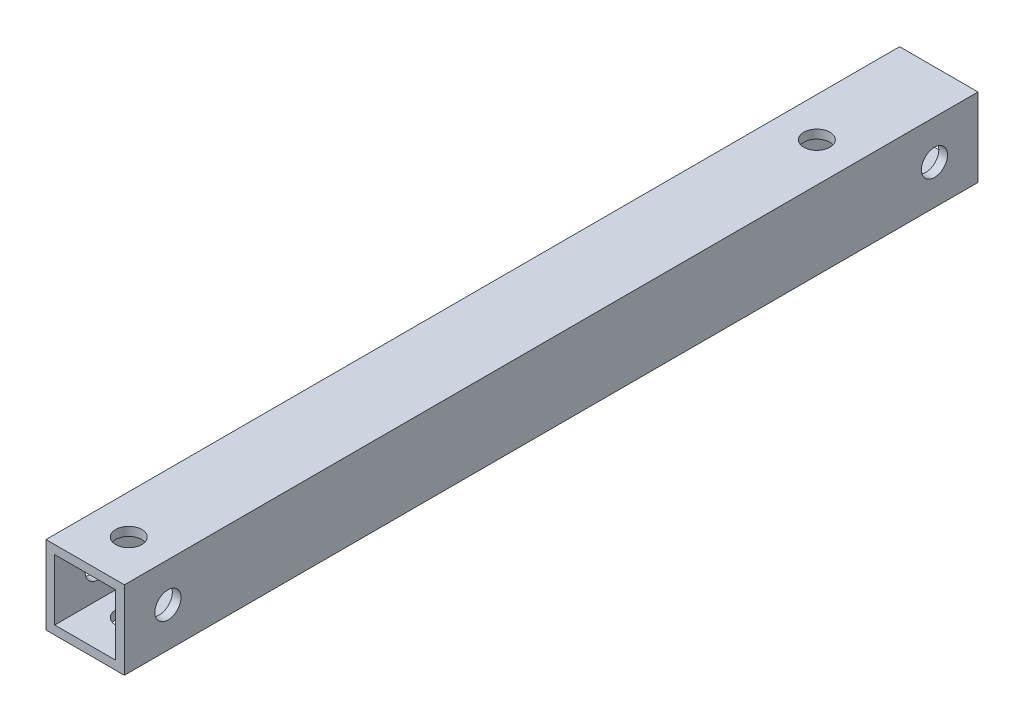
ISO-10303-21;
HEADER;
FILE_DESCRIPTION(('STEP AP214'),'2;1');
FILE_NAME('part.step','',(''),(''),'','','');
FILE_SCHEMA(('AUTOMOTIVE_DESIGN { 1 0 10303 214 1 1 1 1 }'));
ENDSEC;
DATA;
#1=APPLICATION_CONTEXT('core data for automotive mechanical design processes');
#2=APPLICATION_PROTOCOL_DEFINITION('international standard','automotive_design',2000,#1);
#3=PRODUCT_CONTEXT('',#1,'mechanical');
#4=PRODUCT('Part','Part','',(#3));
#5=PRODUCT_RELATED_PRODUCT_CATEGORY('part','',(#4));
#6=PRODUCT_DEFINITION_FORMATION('','',#4);
#7=PRODUCT_DEFINITION_CONTEXT('part definition',#1,'design');
#8=PRODUCT_DEFINITION('design','',#6,#7);
#9=PRODUCT_DEFINITION_SHAPE('','',#8);
#10=(LENGTH_UNIT() NAMED_UNIT(*) SI_UNIT(.MILLI.,.METRE.));
#11=(NAMED_UNIT(*) PLANE_ANGLE_UNIT() SI_UNIT($,.RADIAN.));
#12=(NAMED_UNIT(*) SI_UNIT($,.STERADIAN.) SOLID_ANGLE_UNIT());
#13=UNCERTAINTY_MEASURE_WITH_UNIT(LENGTH_MEASURE(1.E-05),#10,'distance_accuracy_value','');
#14=(GEOMETRIC_REPRESENTATION_CONTEXT(3) GLOBAL_UNCERTAINTY_ASSIGNED_CONTEXT((#13)) GLOBAL_UNIT_ASSIGNED_CONTEXT((#10,
#11,#12)) REPRESENTATION_CONTEXT('',''));
#15=CARTESIAN_POINT('',(0.,0.,0.));
#16=DIRECTION('',(0.,0.,1.));
#17=DIRECTION('',(1.,0.,0.));
#18=AXIS2_PLACEMENT_3D('',#15,#16,#17);
#19=CARTESIAN_POINT('',(4.5,4.5,98.));
#20=DIRECTION('',(-1.,0.,0.));
#21=DIRECTION('',(0.,0.,1.));
#22=AXIS2_PLACEMENT_3D('',#19,#20,#21);
#23=PLANE('',#22);
#24=CARTESIAN_POINT('',(4.5,0.,5.));
#25=DIRECTION('',(-1.,0.,0.));
#26=DIRECTION('',(0.,0.,1.));
#27=AXIS2_PLACEMENT_3D('',#24,#25,#26);
#28=CIRCLE('',#27,1.5);
#29=CARTESIAN_POINT('',(4.5,0.,6.5));
#30=VERTEX_POINT('',#29);
#31=EDGE_CURVE('E194',#30,#30,#28,.T.);
#32=ORIENTED_EDGE('',*,*,#31,.T.);
#33=EDGE_LOOP('',(#32));
#34=FACE_BOUND('',#33,.T.);
#35=CARTESIAN_POINT('',(4.5,0.,93.));
#36=DIRECTION('',(-1.,0.,0.));
#37=DIRECTION('',(0.,0.,1.));
#38=AXIS2_PLACEMENT_3D('',#35,#36,#37);
#39=CIRCLE('',#38,1.5);
#40=CARTESIAN_POINT('',(4.5,0.,94.5));
#41=VERTEX_POINT('',#40);
#42=EDGE_CURVE('E179',#41,#41,#39,.T.);
#43=ORIENTED_EDGE('',*,*,#42,.T.);
#44=EDGE_LOOP('',(#43));
#45=FACE_BOUND('',#44,.T.);
#46=DIRECTION('',(0.,1.,0.));
#47=VECTOR('',#46,1.);
#48=CARTESIAN_POINT('',(4.5,4.5,0.));
#49=LINE('',#48,#47);
#50=CARTESIAN_POINT('',(4.5,-4.5,0.));
#51=VERTEX_POINT('',#50);
#52=CARTESIAN_POINT('',(4.5,4.5,0.));
#53=VERTEX_POINT('',#52);
#54=EDGE_CURVE('E126',#51,#53,#49,.T.);
#55=ORIENTED_EDGE('',*,*,#54,.T.);
#56=DIRECTION('',(0.,0.,-1.));
#57=VECTOR('',#56,1.);
#58=CARTESIAN_POINT('',(4.5,4.5,98.));
#59=LINE('',#58,#57);
#60=CARTESIAN_POINT('',(4.5,4.5,98.));
#61=VERTEX_POINT('',#60);
#62=EDGE_CURVE('E155',#61,#53,#59,.T.);
#63=ORIENTED_EDGE('',*,*,#62,.F.);
#64=DIRECTION('',(0.,1.,0.));
#65=VECTOR('',#64,1.);
#66=CARTESIAN_POINT('',(4.5,4.5,98.));
#67=LINE('',#66,#65);
#68=CARTESIAN_POINT('',(4.5,-4.5,98.));
#69=VERTEX_POINT('',#68);
#70=EDGE_CURVE('E129',#69,#61,#67,.T.);
#71=ORIENTED_EDGE('',*,*,#70,.F.);
#72=DIRECTION('',(0.,0.,-1.));
#73=VECTOR('',#72,1.);
#74=CARTESIAN_POINT('',(4.5,-4.5,98.));
#75=LINE('',#74,#73);
#76=EDGE_CURVE('E139',#69,#51,#75,.T.);
#77=ORIENTED_EDGE('',*,*,#76,.T.);
#78=EDGE_LOOP('',(#55,#63,#71,#77));
#79=FACE_BOUND('',#78,.T.);
#80=ADVANCED_FACE('F34',(#34,#45,#79),#23,.F.);
#81=CARTESIAN_POINT('',(-4.5,4.5,98.));
#82=DIRECTION('',(0.,-1.,0.));
#83=DIRECTION('',(0.,0.,-1.));
#84=AXIS2_PLACEMENT_3D('',#81,#82,#83);
#85=PLANE('',#84);
#86=CARTESIAN_POINT('',(0.,4.5,14.));
#87=DIRECTION('',(0.,1.,0.));
#88=DIRECTION('',(0.,0.,1.));
#89=AXIS2_PLACEMENT_3D('',#86,#87,#88);
#90=CIRCLE('',#89,1.5);
#91=CARTESIAN_POINT('',(0.,4.5,15.5));
#92=VERTEX_POINT('',#91);
#93=EDGE_CURVE('E167',#92,#92,#90,.T.);
#94=ORIENTED_EDGE('',*,*,#93,.F.);
#95=EDGE_LOOP('',(#94));
#96=FACE_BOUND('',#95,.T.);
#97=CARTESIAN_POINT('',(0.,4.5,93.));
#98=DIRECTION('',(0.,1.,0.));
#99=DIRECTION('',(0.,0.,1.));
#100=AXIS2_PLACEMENT_3D('',#97,#98,#99);
#101=CIRCLE('',#100,1.5);
#102=CARTESIAN_POINT('',(0.,4.5,94.5));
#103=VERTEX_POINT('',#102);
#104=EDGE_CURVE('E197',#103,#103,#101,.T.);
#105=ORIENTED_EDGE('',*,*,#104,.F.);
#106=EDGE_LOOP('',(#105));
#107=FACE_BOUND('',#106,.T.);
#108=DIRECTION('',(-1.,0.,0.));
#109=VECTOR('',#108,1.);
#110=CARTESIAN_POINT('',(-4.5,4.5,0.));
#111=LINE('',#110,#109);
#112=CARTESIAN_POINT('',(-4.5,4.5,0.));
#113=VERTEX_POINT('',#112);
#114=EDGE_CURVE('E142',#53,#113,#111,.T.);
#115=ORIENTED_EDGE('',*,*,#114,.T.);
#116=DIRECTION('',(0.,0.,-1.));
#117=VECTOR('',#116,1.);
#118=CARTESIAN_POINT('',(-4.5,4.5,98.));
#119=LINE('',#118,#117);
#120=CARTESIAN_POINT('',(-4.5,4.5,98.));
#121=VERTEX_POINT('',#120);
#122=EDGE_CURVE('E152',#121,#113,#119,.T.);
#123=ORIENTED_EDGE('',*,*,#122,.F.);
#124=DIRECTION('',(-1.,0.,0.));
#125=VECTOR('',#124,1.);
#126=CARTESIAN_POINT('',(-4.5,4.5,98.));
#127=LINE('',#126,#125);
#128=EDGE_CURVE('E132',#61,#121,#127,.T.);
#129=ORIENTED_EDGE('',*,*,#128,.F.);
#130=ORIENTED_EDGE('',*,*,#62,.T.);
#131=EDGE_LOOP('',(#115,#123,#129,#130));
#132=FACE_BOUND('',#131,.T.);
#133=ADVANCED_FACE('F237',(#96,#107,#132),#85,.F.);
#134=CARTESIAN_POINT('',(-4.5,4.5,98.));
#135=DIRECTION('',(1.,0.,0.));
#136=DIRECTION('',(0.,1.,0.));
#137=AXIS2_PLACEMENT_3D('',#134,#135,#136);
#138=PLANE('',#137);
#139=CARTESIAN_POINT('',(-4.5,0.,5.));
#140=DIRECTION('',(-1.,0.,0.));
#141=DIRECTION('',(0.,-1.,0.));
#142=AXIS2_PLACEMENT_3D('',#139,#140,#141);
#143=CIRCLE('',#142,1.5);
#144=CARTESIAN_POINT('',(-4.5,-1.50000000000001,5.));
#145=VERTEX_POINT('',#144);
#146=EDGE_CURVE('E175',#145,#145,#143,.T.);
#147=ORIENTED_EDGE('',*,*,#146,.F.);
#148=EDGE_LOOP('',(#147));
#149=FACE_BOUND('',#148,.T.);
#150=CARTESIAN_POINT('',(-4.5,0.,93.));
#151=DIRECTION('',(-1.,0.,0.));
#152=DIRECTION('',(0.,-1.,0.));
#153=AXIS2_PLACEMENT_3D('',#150,#151,#152);
#154=CIRCLE('',#153,1.5);
#155=CARTESIAN_POINT('',(-4.5,-1.5,93.));
#156=VERTEX_POINT('',#155);
#157=EDGE_CURVE('E182',#156,#156,#154,.T.);
#158=ORIENTED_EDGE('',*,*,#157,.F.);
#159=EDGE_LOOP('',(#158));
#160=FACE_BOUND('',#159,.T.);
#161=DIRECTION('',(0.,-1.,0.));
#162=VECTOR('',#161,1.);
#163=CARTESIAN_POINT('',(-4.5,4.5,0.));
#164=LINE('',#163,#162);
#165=CARTESIAN_POINT('',(-4.5,-4.5,0.));
#166=VERTEX_POINT('',#165);
#167=EDGE_CURVE('E144',#113,#166,#164,.T.);
#168=ORIENTED_EDGE('',*,*,#167,.T.);
#169=DIRECTION('',(0.,0.,-1.));
#170=VECTOR('',#169,1.);
#171=CARTESIAN_POINT('',(-4.5,-4.5,98.));
#172=LINE('',#171,#170);
#173=CARTESIAN_POINT('',(-4.5,-4.5,98.));
#174=VERTEX_POINT('',#173);
#175=EDGE_CURVE('E149',#174,#166,#172,.T.);
#176=ORIENTED_EDGE('',*,*,#175,.F.);
#177=DIRECTION('',(0.,-1.,0.));
#178=VECTOR('',#177,1.);
#179=CARTESIAN_POINT('',(-4.5,4.5,98.));
#180=LINE('',#179,#178);
#181=EDGE_CURVE('E135',#121,#174,#180,.T.);
#182=ORIENTED_EDGE('',*,*,#181,.F.);
#183=ORIENTED_EDGE('',*,*,#122,.T.);
#184=EDGE_LOOP('',(#168,#176,#182,#183));
#185=FACE_BOUND('',#184,.T.);
#186=ADVANCED_FACE('F242',(#149,#160,#185),#138,.F.);
#187=CARTESIAN_POINT('',(-4.5,-4.5,98.));
#188=DIRECTION('',(0.,1.,0.));
#189=DIRECTION('',(0.,0.,1.));
#190=AXIS2_PLACEMENT_3D('',#187,#188,#189);
#191=PLANE('',#190);
#192=CARTESIAN_POINT('',(0.,-4.5,14.));
#193=DIRECTION('',(0.,1.,0.));
#194=DIRECTION('',(0.,0.,1.));
#195=AXIS2_PLACEMENT_3D('',#192,#193,#194);
#196=CIRCLE('',#195,1.5);
#197=CARTESIAN_POINT('',(0.,-4.5,15.5));
#198=VERTEX_POINT('',#197);
#199=EDGE_CURVE('E208',#198,#198,#196,.T.);
#200=ORIENTED_EDGE('',*,*,#199,.T.);
#201=EDGE_LOOP('',(#200));
#202=FACE_BOUND('',#201,.T.);
#203=CARTESIAN_POINT('',(0.,-4.5,93.));
#204=DIRECTION('',(0.,1.,0.));
#205=DIRECTION('',(0.,0.,1.));
#206=AXIS2_PLACEMENT_3D('',#203,#204,#205);
#207=CIRCLE('',#206,1.5);
#208=CARTESIAN_POINT('',(0.,-4.5,94.5));
#209=VERTEX_POINT('',#208);
#210=EDGE_CURVE('E171',#209,#209,#207,.T.);
#211=ORIENTED_EDGE('',*,*,#210,.T.);
#212=EDGE_LOOP('',(#211));
#213=FACE_BOUND('',#212,.T.);
#214=DIRECTION('',(1.,0.,0.));
#215=VECTOR('',#214,1.);
#216=CARTESIAN_POINT('',(-4.5,-4.5,0.));
#217=LINE('',#216,#215);
#218=EDGE_CURVE('E133',#166,#51,#217,.T.);
#219=ORIENTED_EDGE('',*,*,#218,.T.);
#220=ORIENTED_EDGE('',*,*,#76,.F.);
#221=DIRECTION('',(1.,0.,0.));
#222=VECTOR('',#221,1.);
#223=CARTESIAN_POINT('',(-4.5,-4.5,98.));
#224=LINE('',#223,#222);
#225=EDGE_CURVE('E137',#174,#69,#224,.T.);
#226=ORIENTED_EDGE('',*,*,#225,.F.);
#227=ORIENTED_EDGE('',*,*,#175,.T.);
#228=EDGE_LOOP('',(#219,#220,#226,#227));
#229=FACE_BOUND('',#228,.T.);
#230=ADVANCED_FACE('F212',(#202,#213,#229),#191,.F.);
#231=CARTESIAN_POINT('',(0.,0.,98.));
#232=DIRECTION('',(0.,0.,1.));
#233=DIRECTION('',(1.,0.,0.));
#234=AXIS2_PLACEMENT_3D('',#231,#232,#233);
#235=PLANE('',#234);
#236=DIRECTION('',(0.,1.,0.));
#237=VECTOR('',#236,1.);
#238=CARTESIAN_POINT('',(3.5,3.5,98.));
#239=LINE('',#238,#237);
#240=CARTESIAN_POINT('',(3.5,-3.5,98.));
#241=VERTEX_POINT('',#240);
#242=CARTESIAN_POINT('',(3.5,3.5,98.));
#243=VERTEX_POINT('',#242);
#244=EDGE_CURVE('E50',#241,#243,#239,.T.);
#245=ORIENTED_EDGE('',*,*,#244,.F.);
#246=DIRECTION('',(1.,0.,0.));
#247=VECTOR('',#246,1.);
#248=CARTESIAN_POINT('',(-3.5,-3.5,98.));
#249=LINE('',#248,#247);
#250=CARTESIAN_POINT('',(-3.5,-3.5,98.));
#251=VERTEX_POINT('',#250);
#252=EDGE_CURVE('E119',#251,#241,#249,.T.);
#253=ORIENTED_EDGE('',*,*,#252,.F.);
#254=DIRECTION('',(0.,-1.,0.));
#255=VECTOR('',#254,1.);
#256=CARTESIAN_POINT('',(-3.5,3.5,98.));
#257=LINE('',#256,#255);
#258=CARTESIAN_POINT('',(-3.5,3.5,98.));
#259=VERTEX_POINT('',#258);
#260=EDGE_CURVE('E103',#259,#251,#257,.T.);
#261=ORIENTED_EDGE('',*,*,#260,.F.);
#262=DIRECTION('',(-1.,0.,0.));
#263=VECTOR('',#262,1.);
#264=CARTESIAN_POINT('',(-3.5,3.5,98.));
#265=LINE('',#264,#263);
#266=EDGE_CURVE('E112',#243,#259,#265,.T.);
#267=ORIENTED_EDGE('',*,*,#266,.F.);
#268=EDGE_LOOP('',(#245,#253,#261,#267));
#269=FACE_BOUND('',#268,.T.);
#270=ORIENTED_EDGE('',*,*,#70,.T.);
#271=ORIENTED_EDGE('',*,*,#128,.T.);
#272=ORIENTED_EDGE('',*,*,#181,.T.);
#273=ORIENTED_EDGE('',*,*,#225,.T.);
#274=EDGE_LOOP('',(#270,#271,#272,#273));
#275=FACE_BOUND('',#274,.T.);
#276=ADVANCED_FACE('F116',(#269,#275),#235,.T.);
#277=CARTESIAN_POINT('',(0.,0.,0.));
#278=DIRECTION('',(0.,0.,1.));
#279=DIRECTION('',(1.,0.,0.));
#280=AXIS2_PLACEMENT_3D('',#277,#278,#279);
#281=PLANE('',#280);
#282=DIRECTION('',(1.,0.,0.));
#283=VECTOR('',#282,1.);
#284=CARTESIAN_POINT('',(0.,-3.5,0.));
#285=LINE('',#284,#283);
#286=CARTESIAN_POINT('',(-3.5,-3.5,0.));
#287=VERTEX_POINT('',#286);
#288=CARTESIAN_POINT('',(3.5,-3.5,0.));
#289=VERTEX_POINT('',#288);
#290=EDGE_CURVE('E42',#287,#289,#285,.T.);
#291=ORIENTED_EDGE('',*,*,#290,.T.);
#292=DIRECTION('',(0.,1.,0.));
#293=VECTOR('',#292,1.);
#294=CARTESIAN_POINT('',(3.5,0.,0.));
#295=LINE('',#294,#293);
#296=CARTESIAN_POINT('',(3.5,3.5,0.));
#297=VERTEX_POINT('',#296);
#298=EDGE_CURVE('E11',#289,#297,#295,.T.);
#299=ORIENTED_EDGE('',*,*,#298,.T.);
#300=DIRECTION('',(-1.,0.,0.));
#301=VECTOR('',#300,1.);
#302=CARTESIAN_POINT('',(0.,3.5,0.));
#303=LINE('',#302,#301);
#304=CARTESIAN_POINT('',(-3.5,3.5,0.));
#305=VERTEX_POINT('',#304);
#306=EDGE_CURVE('E158',#297,#305,#303,.T.);
#307=ORIENTED_EDGE('',*,*,#306,.T.);
#308=DIRECTION('',(0.,-1.,0.));
#309=VECTOR('',#308,1.);
#310=CARTESIAN_POINT('',(-3.5,0.,0.));
#311=LINE('',#310,#309);
#312=EDGE_CURVE('E106',#305,#287,#311,.T.);
#313=ORIENTED_EDGE('',*,*,#312,.T.);
#314=EDGE_LOOP('',(#291,#299,#307,#313));
#315=FACE_BOUND('',#314,.T.);
#316=ORIENTED_EDGE('',*,*,#54,.F.);
#317=ORIENTED_EDGE('',*,*,#218,.F.);
#318=ORIENTED_EDGE('',*,*,#167,.F.);
#319=ORIENTED_EDGE('',*,*,#114,.F.);
#320=EDGE_LOOP('',(#316,#317,#318,#319));
#321=FACE_BOUND('',#320,.T.);
#322=ADVANCED_FACE('F254',(#315,#321),#281,.F.);
#323=CARTESIAN_POINT('',(3.5,3.5,-8.6));
#324=DIRECTION('',(1.,0.,0.));
#325=DIRECTION('',(0.,1.,0.));
#326=AXIS2_PLACEMENT_3D('',#323,#324,#325);
#327=PLANE('',#326);
#328=CARTESIAN_POINT('',(3.5,0.,5.));
#329=DIRECTION('',(1.,0.,0.));
#330=DIRECTION('',(0.,1.,0.));
#331=AXIS2_PLACEMENT_3D('',#328,#329,#330);
#332=CIRCLE('',#331,1.5);
#333=CARTESIAN_POINT('',(3.5,1.49999999999999,5.));
#334=VERTEX_POINT('',#333);
#335=EDGE_CURVE('E191',#334,#334,#332,.T.);
#336=ORIENTED_EDGE('',*,*,#335,.T.);
#337=EDGE_LOOP('',(#336));
#338=FACE_BOUND('',#337,.T.);
#339=CARTESIAN_POINT('',(3.5,0.,93.));
#340=DIRECTION('',(1.,0.,0.));
#341=DIRECTION('',(0.,1.,0.));
#342=AXIS2_PLACEMENT_3D('',#339,#340,#341);
#343=CIRCLE('',#342,1.5);
#344=CARTESIAN_POINT('',(3.5,1.5,93.));
#345=VERTEX_POINT('',#344);
#346=EDGE_CURVE('E174',#345,#345,#343,.T.);
#347=ORIENTED_EDGE('',*,*,#346,.T.);
#348=EDGE_LOOP('',(#347));
#349=FACE_BOUND('',#348,.T.);
#350=DIRECTION('',(0.,0.,1.));
#351=VECTOR('',#350,1.);
#352=CARTESIAN_POINT('',(3.5,-3.5,-8.6));
#353=LINE('',#352,#351);
#354=EDGE_CURVE('E124',#289,#241,#353,.T.);
#355=ORIENTED_EDGE('',*,*,#354,.T.);
#356=ORIENTED_EDGE('',*,*,#244,.T.);
#357=DIRECTION('',(0.,0.,1.));
#358=VECTOR('',#357,1.);
#359=CARTESIAN_POINT('',(3.5,3.5,-8.6));
#360=LINE('',#359,#358);
#361=EDGE_CURVE('E109',#297,#243,#360,.T.);
#362=ORIENTED_EDGE('',*,*,#361,.F.);
#363=ORIENTED_EDGE('',*,*,#298,.F.);
#364=EDGE_LOOP('',(#355,#356,#362,#363));
#365=FACE_BOUND('',#364,.T.);
#366=ADVANCED_FACE('F274',(#338,#349,#365),#327,.F.);
#367=CARTESIAN_POINT('',(-3.5,-3.5,-8.6));
#368=DIRECTION('',(0.,-1.,0.));
#369=DIRECTION('',(0.,0.,-1.));
#370=AXIS2_PLACEMENT_3D('',#367,#368,#369);
#371=PLANE('',#370);
#372=CARTESIAN_POINT('',(0.,-3.5,14.));
#373=DIRECTION('',(0.,-1.,0.));
#374=DIRECTION('',(0.,0.,-1.));
#375=AXIS2_PLACEMENT_3D('',#372,#373,#374);
#376=CIRCLE('',#375,1.5);
#377=CARTESIAN_POINT('',(0.,-3.5,12.5));
#378=VERTEX_POINT('',#377);
#379=EDGE_CURVE('E170',#378,#378,#376,.T.);
#380=ORIENTED_EDGE('',*,*,#379,.T.);
#381=EDGE_LOOP('',(#380));
#382=FACE_BOUND('',#381,.T.);
#383=CARTESIAN_POINT('',(0.,-3.5,93.));
#384=DIRECTION('',(0.,-1.,0.));
#385=DIRECTION('',(0.,0.,-1.));
#386=AXIS2_PLACEMENT_3D('',#383,#384,#385);
#387=CIRCLE('',#386,1.5);
#388=CARTESIAN_POINT('',(0.,-3.5,91.5));
#389=VERTEX_POINT('',#388);
#390=EDGE_CURVE('E166',#389,#389,#387,.T.);
#391=ORIENTED_EDGE('',*,*,#390,.T.);
#392=EDGE_LOOP('',(#391));
#393=FACE_BOUND('',#392,.T.);
#394=DIRECTION('',(0.,0.,1.));
#395=VECTOR('',#394,1.);
#396=CARTESIAN_POINT('',(-3.5,-3.5,-8.6));
#397=LINE('',#396,#395);
#398=EDGE_CURVE('E108',#287,#251,#397,.T.);
#399=ORIENTED_EDGE('',*,*,#398,.T.);
#400=ORIENTED_EDGE('',*,*,#252,.T.);
#401=ORIENTED_EDGE('',*,*,#354,.F.);
#402=ORIENTED_EDGE('',*,*,#290,.F.);
#403=EDGE_LOOP('',(#399,#400,#401,#402));
#404=FACE_BOUND('',#403,.T.);
#405=ADVANCED_FACE('F280',(#382,#393,#404),#371,.F.);
#406=CARTESIAN_POINT('',(-3.5,3.5,-8.6));
#407=DIRECTION('',(-1.,0.,0.));
#408=DIRECTION('',(0.,-1.,0.));
#409=AXIS2_PLACEMENT_3D('',#406,#407,#408);
#410=PLANE('',#409);
#411=CARTESIAN_POINT('',(-3.5,0.,5.));
#412=DIRECTION('',(-1.,0.,0.));
#413=DIRECTION('',(0.,-1.,0.));
#414=AXIS2_PLACEMENT_3D('',#411,#412,#413);
#415=CIRCLE('',#414,1.5);
#416=CARTESIAN_POINT('',(-3.5,-1.50000000000001,5.));
#417=VERTEX_POINT('',#416);
#418=EDGE_CURVE('E37',#417,#417,#415,.T.);
#419=ORIENTED_EDGE('',*,*,#418,.T.);
#420=EDGE_LOOP('',(#419));
#421=FACE_BOUND('',#420,.T.);
#422=CARTESIAN_POINT('',(-3.5,0.,93.));
#423=DIRECTION('',(-1.,0.,0.));
#424=DIRECTION('',(0.,-1.,0.));
#425=AXIS2_PLACEMENT_3D('',#422,#423,#424);
#426=CIRCLE('',#425,1.5);
#427=CARTESIAN_POINT('',(-3.5,-1.5,93.));
#428=VERTEX_POINT('',#427);
#429=EDGE_CURVE('E172',#428,#428,#426,.T.);
#430=ORIENTED_EDGE('',*,*,#429,.T.);
#431=EDGE_LOOP('',(#430));
#432=FACE_BOUND('',#431,.T.);
#433=DIRECTION('',(0.,0.,1.));
#434=VECTOR('',#433,1.);
#435=CARTESIAN_POINT('',(-3.5,3.5,-8.6));
#436=LINE('',#435,#434);
#437=EDGE_CURVE('E58',#305,#259,#436,.T.);
#438=ORIENTED_EDGE('',*,*,#437,.T.);
#439=ORIENTED_EDGE('',*,*,#260,.T.);
#440=ORIENTED_EDGE('',*,*,#398,.F.);
#441=ORIENTED_EDGE('',*,*,#312,.F.);
#442=EDGE_LOOP('',(#438,#439,#440,#441));
#443=FACE_BOUND('',#442,.T.);
#444=ADVANCED_FACE('F100',(#421,#432,#443),#410,.F.);
#445=CARTESIAN_POINT('',(-3.5,3.5,-8.6));
#446=DIRECTION('',(0.,1.,0.));
#447=DIRECTION('',(0.,0.,1.));
#448=AXIS2_PLACEMENT_3D('',#445,#446,#447);
#449=PLANE('',#448);
#450=CARTESIAN_POINT('',(0.,3.5,14.));
#451=DIRECTION('',(0.,1.,0.));
#452=DIRECTION('',(0.,0.,1.));
#453=AXIS2_PLACEMENT_3D('',#450,#451,#452);
#454=CIRCLE('',#453,1.5);
#455=CARTESIAN_POINT('',(0.,3.5,15.5));
#456=VERTEX_POINT('',#455);
#457=EDGE_CURVE('E168',#456,#456,#454,.T.);
#458=ORIENTED_EDGE('',*,*,#457,.T.);
#459=EDGE_LOOP('',(#458));
#460=FACE_BOUND('',#459,.T.);
#461=CARTESIAN_POINT('',(0.,3.5,93.));
#462=DIRECTION('',(0.,1.,0.));
#463=DIRECTION('',(0.,0.,1.));
#464=AXIS2_PLACEMENT_3D('',#461,#462,#463);
#465=CIRCLE('',#464,1.5);
#466=CARTESIAN_POINT('',(0.,3.5,94.5));
#467=VERTEX_POINT('',#466);
#468=EDGE_CURVE('E163',#467,#467,#465,.T.);
#469=ORIENTED_EDGE('',*,*,#468,.T.);
#470=EDGE_LOOP('',(#469));
#471=FACE_BOUND('',#470,.T.);
#472=ORIENTED_EDGE('',*,*,#361,.T.);
#473=ORIENTED_EDGE('',*,*,#266,.T.);
#474=ORIENTED_EDGE('',*,*,#437,.F.);
#475=ORIENTED_EDGE('',*,*,#306,.F.);
#476=EDGE_LOOP('',(#472,#473,#474,#475));
#477=FACE_BOUND('',#476,.T.);
#478=ADVANCED_FACE('F113',(#460,#471,#477),#449,.F.);
#479=CARTESIAN_POINT('',(0.,-102.1,93.));
#480=DIRECTION('',(0.,1.,0.));
#481=DIRECTION('',(0.,0.,1.));
#482=AXIS2_PLACEMENT_3D('',#479,#480,#481);
#483=CYLINDRICAL_SURFACE('',#482,1.5);
#484=ORIENTED_EDGE('',*,*,#104,.T.);
#485=EDGE_LOOP('',(#484));
#486=FACE_BOUND('',#485,.T.);
#487=ORIENTED_EDGE('',*,*,#468,.F.);
#488=EDGE_LOOP('',(#487));
#489=FACE_BOUND('',#488,.T.);
#490=ADVANCED_FACE('F232',(#486,#489),#483,.F.);
#491=CARTESIAN_POINT('',(0.,-102.1,14.));
#492=DIRECTION('',(0.,1.,0.));
#493=DIRECTION('',(0.,0.,1.));
#494=AXIS2_PLACEMENT_3D('',#491,#492,#493);
#495=CYLINDRICAL_SURFACE('',#494,1.5);
#496=ORIENTED_EDGE('',*,*,#93,.T.);
#497=EDGE_LOOP('',(#496));
#498=FACE_BOUND('',#497,.T.);
#499=ORIENTED_EDGE('',*,*,#457,.F.);
#500=EDGE_LOOP('',(#499));
#501=FACE_BOUND('',#500,.T.);
#502=ADVANCED_FACE('F221',(#498,#501),#495,.F.);
#503=ORIENTED_EDGE('',*,*,#390,.F.);
#504=EDGE_LOOP('',(#503));
#505=FACE_BOUND('',#504,.T.);
#506=ORIENTED_EDGE('',*,*,#210,.F.);
#507=EDGE_LOOP('',(#506));
#508=FACE_BOUND('',#507,.T.);
#509=ADVANCED_FACE('F218',(#505,#508),#483,.F.);
#510=ORIENTED_EDGE('',*,*,#379,.F.);
#511=EDGE_LOOP('',(#510));
#512=FACE_BOUND('',#511,.T.);
#513=ORIENTED_EDGE('',*,*,#199,.F.);
#514=EDGE_LOOP('',(#513));
#515=FACE_BOUND('',#514,.T.);
#516=ADVANCED_FACE('F215',(#512,#515),#495,.F.);
#517=CARTESIAN_POINT('',(45.5,0.,93.));
#518=DIRECTION('',(-1.,0.,0.));
#519=DIRECTION('',(0.,-1.,0.));
#520=AXIS2_PLACEMENT_3D('',#517,#518,#519);
#521=CYLINDRICAL_SURFACE('',#520,1.5);
#522=ORIENTED_EDGE('',*,*,#157,.T.);
#523=EDGE_LOOP('',(#522));
#524=FACE_BOUND('',#523,.T.);
#525=ORIENTED_EDGE('',*,*,#429,.F.);
#526=EDGE_LOOP('',(#525));
#527=FACE_BOUND('',#526,.T.);
#528=ADVANCED_FACE('F217',(#524,#527),#521,.F.);
#529=CARTESIAN_POINT('',(45.5,0.,5.));
#530=DIRECTION('',(-1.,0.,0.));
#531=DIRECTION('',(0.,-1.,0.));
#532=AXIS2_PLACEMENT_3D('',#529,#530,#531);
#533=CYLINDRICAL_SURFACE('',#532,1.5);
#534=ORIENTED_EDGE('',*,*,#146,.T.);
#535=EDGE_LOOP('',(#534));
#536=FACE_BOUND('',#535,.T.);
#537=ORIENTED_EDGE('',*,*,#418,.F.);
#538=EDGE_LOOP('',(#537));
#539=FACE_BOUND('',#538,.T.);
#540=ADVANCED_FACE('F226',(#536,#539),#533,.F.);
#541=ORIENTED_EDGE('',*,*,#346,.F.);
#542=EDGE_LOOP('',(#541));
#543=FACE_BOUND('',#542,.T.);
#544=ORIENTED_EDGE('',*,*,#42,.F.);
#545=EDGE_LOOP('',(#544));
#546=FACE_BOUND('',#545,.T.);
#547=ADVANCED_FACE('F229',(#543,#546),#521,.F.);
#548=ORIENTED_EDGE('',*,*,#335,.F.);
#549=EDGE_LOOP('',(#548));
#550=FACE_BOUND('',#549,.T.);
#551=ORIENTED_EDGE('',*,*,#31,.F.);
#552=EDGE_LOOP('',(#551));
#553=FACE_BOUND('',#552,.T.);
#554=ADVANCED_FACE('F388',(#550,#553),#533,.F.);
#555=CLOSED_SHELL('',(#80,#133,#186,#230,#276,#322,#366,#405,#444,#478,#490,#502,#509,#516,#528,
#540,#547,#554));
#556=MANIFOLD_SOLID_BREP('B2',#555);
#557=ADVANCED_BREP_SHAPE_REPRESENTATION('',(#18,#556),#14);
#558=SHAPE_DEFINITION_REPRESENTATION(#9,#557);
ENDSEC;
END-ISO-10303-21;
